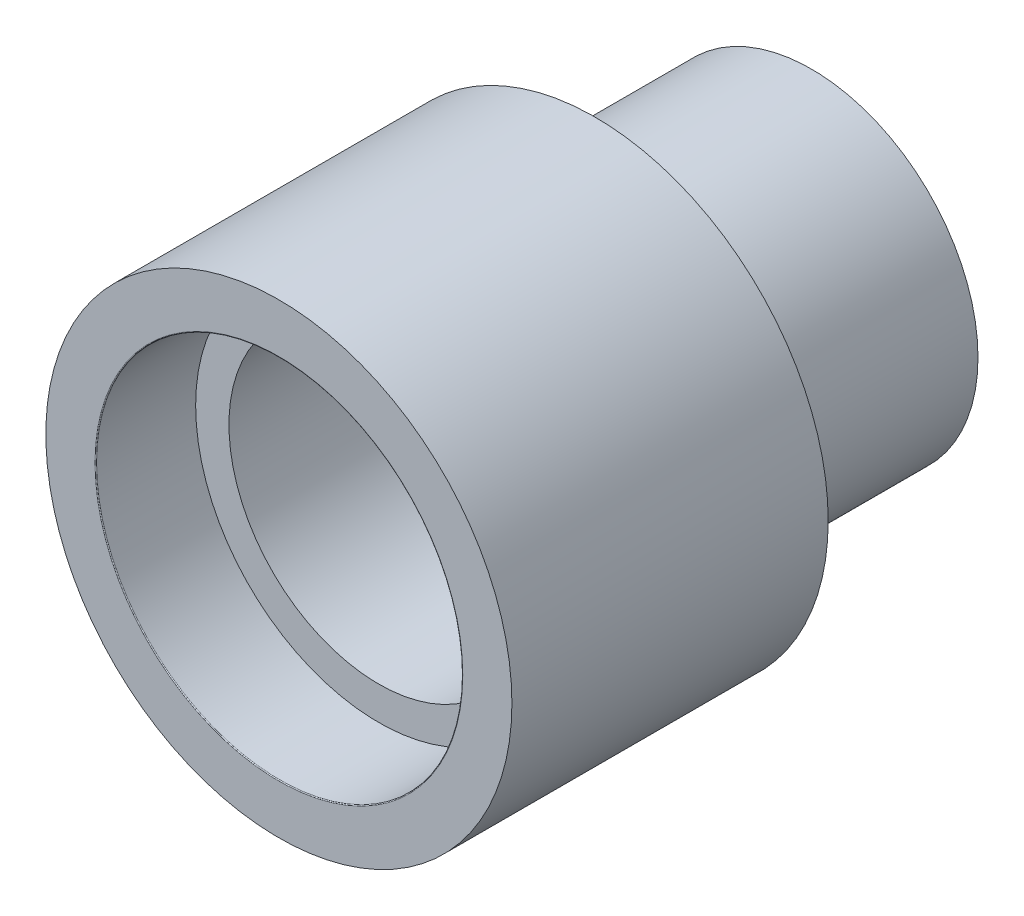
ISO-10303-21;
HEADER;
FILE_DESCRIPTION(('STEP AP214'),'2;1');
FILE_NAME('part.step','',(''),(''),'','','');
FILE_SCHEMA(('AUTOMOTIVE_DESIGN { 1 0 10303 214 1 1 1 1 }'));
ENDSEC;
DATA;
#1=APPLICATION_CONTEXT('core data for automotive mechanical design processes');
#2=APPLICATION_PROTOCOL_DEFINITION('international standard','automotive_design',2000,#1);
#3=PRODUCT_CONTEXT('',#1,'mechanical');
#4=PRODUCT('Part','Part','',(#3));
#5=PRODUCT_RELATED_PRODUCT_CATEGORY('part','',(#4));
#6=PRODUCT_DEFINITION_FORMATION('','',#4);
#7=PRODUCT_DEFINITION_CONTEXT('part definition',#1,'design');
#8=PRODUCT_DEFINITION('design','',#6,#7);
#9=PRODUCT_DEFINITION_SHAPE('','',#8);
#10=(LENGTH_UNIT() NAMED_UNIT(*) SI_UNIT(.MILLI.,.METRE.));
#11=(NAMED_UNIT(*) PLANE_ANGLE_UNIT() SI_UNIT($,.RADIAN.));
#12=(NAMED_UNIT(*) SI_UNIT($,.STERADIAN.) SOLID_ANGLE_UNIT());
#13=UNCERTAINTY_MEASURE_WITH_UNIT(LENGTH_MEASURE(1.E-05),#10,'distance_accuracy_value','');
#14=(GEOMETRIC_REPRESENTATION_CONTEXT(3) GLOBAL_UNCERTAINTY_ASSIGNED_CONTEXT((#13)) GLOBAL_UNIT_ASSIGNED_CONTEXT((#10,
#11,#12)) REPRESENTATION_CONTEXT('',''));
#15=CARTESIAN_POINT('',(0.,0.,0.));
#16=DIRECTION('',(0.,0.,1.));
#17=DIRECTION('',(1.,0.,0.));
#18=AXIS2_PLACEMENT_3D('',#15,#16,#17);
#19=CARTESIAN_POINT('',(0.,0.,-13.));
#20=DIRECTION('',(0.,0.,1.));
#21=DIRECTION('',(1.,0.,0.));
#22=AXIS2_PLACEMENT_3D('',#19,#20,#21);
#23=CYLINDRICAL_SURFACE('',#22,10.);
#24=CARTESIAN_POINT('',(0.,0.,-13.));
#25=DIRECTION('',(0.,0.,1.));
#26=DIRECTION('',(1.,0.,0.));
#27=AXIS2_PLACEMENT_3D('',#24,#25,#26);
#28=CIRCLE('',#27,10.);
#29=CARTESIAN_POINT('',(10.,0.,-13.));
#30=VERTEX_POINT('',#29);
#31=EDGE_CURVE('E54',#30,#30,#28,.T.);
#32=ORIENTED_EDGE('',*,*,#31,.T.);
#33=EDGE_LOOP('',(#32));
#34=FACE_BOUND('',#33,.T.);
#35=CARTESIAN_POINT('',(0.,0.,0.));
#36=DIRECTION('',(0.,0.,1.));
#37=DIRECTION('',(1.,0.,0.));
#38=AXIS2_PLACEMENT_3D('',#35,#36,#37);
#39=CIRCLE('',#38,10.);
#40=CARTESIAN_POINT('',(10.,0.,0.));
#41=VERTEX_POINT('',#40);
#42=EDGE_CURVE('E59',#41,#41,#39,.T.);
#43=ORIENTED_EDGE('',*,*,#42,.F.);
#44=EDGE_LOOP('',(#43));
#45=FACE_BOUND('',#44,.T.);
#46=ADVANCED_FACE('F41',(#34,#45),#23,.T.);
#47=CARTESIAN_POINT('',(0.,0.,-13.));
#48=DIRECTION('',(0.,0.,1.));
#49=DIRECTION('',(1.,0.,0.));
#50=AXIS2_PLACEMENT_3D('',#47,#48,#49);
#51=PLANE('',#50);
#52=CARTESIAN_POINT('',(0.,0.,-13.));
#53=DIRECTION('',(0.,0.,-1.));
#54=DIRECTION('',(-1.,0.,0.));
#55=AXIS2_PLACEMENT_3D('',#52,#53,#54);
#56=CIRCLE('',#55,5.);
#57=CARTESIAN_POINT('',(-5.,0.,-13.));
#58=VERTEX_POINT('',#57);
#59=EDGE_CURVE('E67',#58,#58,#56,.T.);
#60=ORIENTED_EDGE('',*,*,#59,.F.);
#61=EDGE_LOOP('',(#60));
#62=FACE_BOUND('',#61,.T.);
#63=ORIENTED_EDGE('',*,*,#31,.F.);
#64=EDGE_LOOP('',(#63));
#65=FACE_BOUND('',#64,.T.);
#66=ADVANCED_FACE('F96',(#62,#65),#51,.F.);
#67=CARTESIAN_POINT('',(0.,0.,19.));
#68=DIRECTION('',(0.,0.,-1.));
#69=DIRECTION('',(-1.,0.,0.));
#70=AXIS2_PLACEMENT_3D('',#67,#68,#69);
#71=CYLINDRICAL_SURFACE('',#70,14.);
#72=CARTESIAN_POINT('',(0.,0.,19.));
#73=DIRECTION('',(0.,0.,1.));
#74=DIRECTION('',(1.,0.,0.));
#75=AXIS2_PLACEMENT_3D('',#72,#73,#74);
#76=CIRCLE('',#75,14.);
#77=CARTESIAN_POINT('',(14.,0.,19.));
#78=VERTEX_POINT('',#77);
#79=EDGE_CURVE('E70',#78,#78,#76,.T.);
#80=ORIENTED_EDGE('',*,*,#79,.F.);
#81=EDGE_LOOP('',(#80));
#82=FACE_BOUND('',#81,.T.);
#83=CARTESIAN_POINT('',(0.,0.,0.));
#84=DIRECTION('',(0.,0.,1.));
#85=DIRECTION('',(1.,0.,0.));
#86=AXIS2_PLACEMENT_3D('',#83,#84,#85);
#87=CIRCLE('',#86,14.);
#88=CARTESIAN_POINT('',(14.,0.,0.));
#89=VERTEX_POINT('',#88);
#90=EDGE_CURVE('E72',#89,#89,#87,.T.);
#91=ORIENTED_EDGE('',*,*,#90,.T.);
#92=EDGE_LOOP('',(#91));
#93=FACE_BOUND('',#92,.T.);
#94=ADVANCED_FACE('F99',(#82,#93),#71,.T.);
#95=CARTESIAN_POINT('',(0.,0.,19.));
#96=DIRECTION('',(0.,0.,1.));
#97=DIRECTION('',(1.,0.,0.));
#98=AXIS2_PLACEMENT_3D('',#95,#96,#97);
#99=PLANE('',#98);
#100=CARTESIAN_POINT('',(0.,0.,19.));
#101=DIRECTION('',(0.,0.,1.));
#102=DIRECTION('',(1.,0.,0.));
#103=AXIS2_PLACEMENT_3D('',#100,#101,#102);
#104=CIRCLE('',#103,11.05);
#105=CARTESIAN_POINT('',(11.05,0.,19.));
#106=VERTEX_POINT('',#105);
#107=EDGE_CURVE('E10',#106,#106,#104,.F.);
#108=ORIENTED_EDGE('',*,*,#107,.T.);
#109=EDGE_LOOP('',(#108));
#110=FACE_BOUND('',#109,.T.);
#111=ORIENTED_EDGE('',*,*,#79,.T.);
#112=EDGE_LOOP('',(#111));
#113=FACE_BOUND('',#112,.T.);
#114=ADVANCED_FACE('F111',(#110,#113),#99,.T.);
#115=CARTESIAN_POINT('',(0.,0.,0.));
#116=DIRECTION('',(0.,0.,1.));
#117=DIRECTION('',(1.,0.,0.));
#118=AXIS2_PLACEMENT_3D('',#115,#116,#117);
#119=PLANE('',#118);
#120=ORIENTED_EDGE('',*,*,#42,.T.);
#121=EDGE_LOOP('',(#120));
#122=FACE_BOUND('',#121,.T.);
#123=ORIENTED_EDGE('',*,*,#90,.F.);
#124=EDGE_LOOP('',(#123));
#125=FACE_BOUND('',#124,.T.);
#126=ADVANCED_FACE('F107',(#122,#125),#119,.F.);
#127=CARTESIAN_POINT('',(0.,0.,13.));
#128=DIRECTION('',(0.,0.,1.));
#129=DIRECTION('',(1.,0.,0.));
#130=AXIS2_PLACEMENT_3D('',#127,#128,#129);
#131=CYLINDRICAL_SURFACE('',#130,11.);
#132=CARTESIAN_POINT('',(0.,0.,18.95));
#133=DIRECTION('',(0.,0.,1.));
#134=DIRECTION('',(1.,0.,0.));
#135=AXIS2_PLACEMENT_3D('',#132,#133,#134);
#136=CIRCLE('',#135,11.);
#137=CARTESIAN_POINT('',(11.,0.,18.95));
#138=VERTEX_POINT('',#137);
#139=EDGE_CURVE('E49',#138,#138,#136,.T.);
#140=ORIENTED_EDGE('',*,*,#139,.T.);
#141=EDGE_LOOP('',(#140));
#142=FACE_BOUND('',#141,.T.);
#143=CARTESIAN_POINT('',(0.,0.,13.));
#144=DIRECTION('',(0.,0.,1.));
#145=DIRECTION('',(1.,0.,0.));
#146=AXIS2_PLACEMENT_3D('',#143,#144,#145);
#147=CIRCLE('',#146,11.);
#148=CARTESIAN_POINT('',(11.,0.,13.));
#149=VERTEX_POINT('',#148);
#150=EDGE_CURVE('E76',#149,#149,#147,.T.);
#151=ORIENTED_EDGE('',*,*,#150,.F.);
#152=EDGE_LOOP('',(#151));
#153=FACE_BOUND('',#152,.T.);
#154=ADVANCED_FACE('F110',(#142,#153),#131,.F.);
#155=CARTESIAN_POINT('',(0.,0.,13.));
#156=DIRECTION('',(0.,0.,1.));
#157=DIRECTION('',(1.,0.,0.));
#158=AXIS2_PLACEMENT_3D('',#155,#156,#157);
#159=PLANE('',#158);
#160=CARTESIAN_POINT('',(0.,0.,13.));
#161=DIRECTION('',(0.,0.,1.));
#162=DIRECTION('',(1.,0.,0.));
#163=AXIS2_PLACEMENT_3D('',#160,#161,#162);
#164=CIRCLE('',#163,9.);
#165=CARTESIAN_POINT('',(9.,0.,13.));
#166=VERTEX_POINT('',#165);
#167=EDGE_CURVE('E66',#166,#166,#164,.T.);
#168=ORIENTED_EDGE('',*,*,#167,.F.);
#169=EDGE_LOOP('',(#168));
#170=FACE_BOUND('',#169,.T.);
#171=ORIENTED_EDGE('',*,*,#150,.T.);
#172=EDGE_LOOP('',(#171));
#173=FACE_BOUND('',#172,.T.);
#174=ADVANCED_FACE('F126',(#170,#173),#159,.T.);
#175=CARTESIAN_POINT('',(0.,0.,3.));
#176=DIRECTION('',(0.,0.,1.));
#177=DIRECTION('',(1.,0.,0.));
#178=AXIS2_PLACEMENT_3D('',#175,#176,#177);
#179=CYLINDRICAL_SURFACE('',#178,9.);
#180=CARTESIAN_POINT('',(0.,0.,3.));
#181=DIRECTION('',(0.,0.,1.));
#182=DIRECTION('',(1.,0.,0.));
#183=AXIS2_PLACEMENT_3D('',#180,#181,#182);
#184=CIRCLE('',#183,9.);
#185=CARTESIAN_POINT('',(9.,0.,3.));
#186=VERTEX_POINT('',#185);
#187=EDGE_CURVE('E83',#186,#186,#184,.T.);
#188=ORIENTED_EDGE('',*,*,#187,.F.);
#189=EDGE_LOOP('',(#188));
#190=FACE_BOUND('',#189,.T.);
#191=ORIENTED_EDGE('',*,*,#167,.T.);
#192=EDGE_LOOP('',(#191));
#193=FACE_BOUND('',#192,.T.);
#194=ADVANCED_FACE('F129',(#190,#193),#179,.F.);
#195=CARTESIAN_POINT('',(0.,0.,3.));
#196=DIRECTION('',(0.,0.,1.));
#197=DIRECTION('',(1.,0.,0.));
#198=AXIS2_PLACEMENT_3D('',#195,#196,#197);
#199=PLANE('',#198);
#200=CARTESIAN_POINT('',(0.,0.,3.));
#201=DIRECTION('',(0.,0.,1.));
#202=DIRECTION('',(1.,0.,0.));
#203=AXIS2_PLACEMENT_3D('',#200,#201,#202);
#204=CIRCLE('',#203,5.);
#205=CARTESIAN_POINT('',(5.,0.,3.));
#206=VERTEX_POINT('',#205);
#207=EDGE_CURVE('E62',#206,#206,#204,.T.);
#208=ORIENTED_EDGE('',*,*,#207,.F.);
#209=EDGE_LOOP('',(#208));
#210=FACE_BOUND('',#209,.T.);
#211=ORIENTED_EDGE('',*,*,#187,.T.);
#212=EDGE_LOOP('',(#211));
#213=FACE_BOUND('',#212,.T.);
#214=ADVANCED_FACE('F133',(#210,#213),#199,.T.);
#215=CARTESIAN_POINT('',(0.,0.,19.));
#216=DIRECTION('',(0.,0.,-1.));
#217=DIRECTION('',(-1.,0.,0.));
#218=AXIS2_PLACEMENT_3D('',#215,#216,#217);
#219=CYLINDRICAL_SURFACE('',#218,5.);
#220=ORIENTED_EDGE('',*,*,#207,.T.);
#221=EDGE_LOOP('',(#220));
#222=FACE_BOUND('',#221,.T.);
#223=ORIENTED_EDGE('',*,*,#59,.T.);
#224=EDGE_LOOP('',(#223));
#225=FACE_BOUND('',#224,.T.);
#226=ADVANCED_FACE('F94',(#222,#225),#219,.F.);
#227=CARTESIAN_POINT('',(0.,0.,18.95));
#228=DIRECTION('',(0.,0.,1.));
#229=DIRECTION('',(1.,0.,0.));
#230=AXIS2_PLACEMENT_3D('',#227,#228,#229);
#231=TOROIDAL_SURFACE('',#230,11.05,0.05);
#232=ORIENTED_EDGE('',*,*,#107,.F.);
#233=EDGE_LOOP('',(#232));
#234=FACE_BOUND('',#233,.T.);
#235=ORIENTED_EDGE('',*,*,#139,.F.);
#236=EDGE_LOOP('',(#235));
#237=FACE_BOUND('',#236,.T.);
#238=ADVANCED_FACE('F43',(#234,#237),#231,.T.);
#239=CLOSED_SHELL('',(#46,#66,#94,#114,#126,#154,#174,#194,#214,#226,#238));
#240=MANIFOLD_SOLID_BREP('B2',#239);
#241=ADVANCED_BREP_SHAPE_REPRESENTATION('',(#18,#240),#14);
#242=SHAPE_DEFINITION_REPRESENTATION(#9,#241);
ENDSEC;
END-ISO-10303-21;
